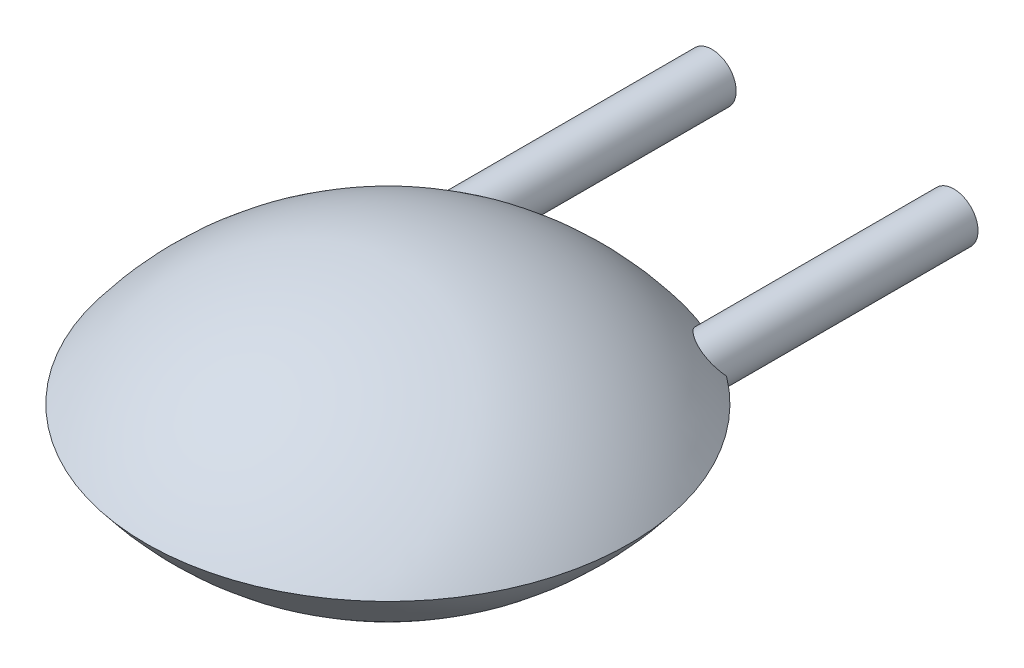
ISO-10303-21;
HEADER;
FILE_DESCRIPTION(('STEP AP214'),'2;1');
FILE_NAME('part.step','',(''),(''),'','','');
FILE_SCHEMA(('AUTOMOTIVE_DESIGN { 1 0 10303 214 1 1 1 1 }'));
ENDSEC;
DATA;
#1=APPLICATION_CONTEXT('core data for automotive mechanical design processes');
#2=APPLICATION_PROTOCOL_DEFINITION('international standard','automotive_design',2000,#1);
#3=PRODUCT_CONTEXT('',#1,'mechanical');
#4=PRODUCT('Part','Part','',(#3));
#5=PRODUCT_RELATED_PRODUCT_CATEGORY('part','',(#4));
#6=PRODUCT_DEFINITION_FORMATION('','',#4);
#7=PRODUCT_DEFINITION_CONTEXT('part definition',#1,'design');
#8=PRODUCT_DEFINITION('design','',#6,#7);
#9=PRODUCT_DEFINITION_SHAPE('','',#8);
#10=(LENGTH_UNIT() NAMED_UNIT(*) SI_UNIT(.MILLI.,.METRE.));
#11=(NAMED_UNIT(*) PLANE_ANGLE_UNIT() SI_UNIT($,.RADIAN.));
#12=(NAMED_UNIT(*) SI_UNIT($,.STERADIAN.) SOLID_ANGLE_UNIT());
#13=UNCERTAINTY_MEASURE_WITH_UNIT(LENGTH_MEASURE(1.E-05),#10,'distance_accuracy_value','');
#14=(GEOMETRIC_REPRESENTATION_CONTEXT(3) GLOBAL_UNCERTAINTY_ASSIGNED_CONTEXT((#13)) GLOBAL_UNIT_ASSIGNED_CONTEXT((#10,
#11,#12)) REPRESENTATION_CONTEXT('',''));
#15=CARTESIAN_POINT('',(0.,0.,0.));
#16=DIRECTION('',(0.,0.,1.));
#17=DIRECTION('',(1.,0.,0.));
#18=AXIS2_PLACEMENT_3D('',#15,#16,#17);
#19=CARTESIAN_POINT('',(-0.255,-0.25,-2.));
#20=DIRECTION('',(0.,0.,-1.));
#21=DIRECTION('',(0.,1.,0.));
#22=AXIS2_PLACEMENT_3D('',#19,#20,#21);
#23=PLANE('',#22);
#24=CARTESIAN_POINT('',(0.,1.26580603637683E-13,-2.));
#25=DIRECTION('',(0.,0.,-1.));
#26=DIRECTION('',(-1.,0.,0.));
#27=AXIS2_PLACEMENT_3D('',#24,#25,#26);
#28=CIRCLE('',#27,0.249999999999979);
#29=CARTESIAN_POINT('',(-0.249999999999979,1.26580603637683E-13,-2.));
#30=VERTEX_POINT('',#29);
#31=EDGE_CURVE('E22',#30,#30,#28,.F.);
#32=ORIENTED_EDGE('',*,*,#31,.F.);
#33=EDGE_LOOP('',(#32));
#34=FACE_BOUND('',#33,.T.);
#35=ADVANCED_FACE('F17',(#34),#23,.T.);
#36=CARTESIAN_POINT('',(2.755,0.25,-2.));
#37=DIRECTION('',(0.,0.,-1.));
#38=DIRECTION('',(0.,-1.,0.));
#39=AXIS2_PLACEMENT_3D('',#36,#37,#38);
#40=PLANE('',#39);
#41=CARTESIAN_POINT('',(2.5,-1.26824549126492E-13,-2.));
#42=DIRECTION('',(0.,0.,-1.));
#43=DIRECTION('',(-1.,0.,0.));
#44=AXIS2_PLACEMENT_3D('',#41,#42,#43);
#45=CIRCLE('',#44,0.249999999999979);
#46=CARTESIAN_POINT('',(2.25000000000002,-1.26824549126492E-13,-2.));
#47=VERTEX_POINT('',#46);
#48=EDGE_CURVE('E79',#47,#47,#45,.F.);
#49=ORIENTED_EDGE('',*,*,#48,.F.);
#50=EDGE_LOOP('',(#49));
#51=FACE_BOUND('',#50,.T.);
#52=ADVANCED_FACE('F90',(#51),#40,.T.);
#53=CARTESIAN_POINT('',(0.,1.26580603637683E-13,0.75717542912601));
#54=DIRECTION('',(0.,0.,-1.));
#55=DIRECTION('',(-1.,0.,0.));
#56=AXIS2_PLACEMENT_3D('',#53,#54,#55);
#57=CYLINDRICAL_SURFACE('',#56,0.249999999999979);
#58=CARTESIAN_POINT('',(0.249999999999979,0.,0.308712152522118));
#59=CARTESIAN_POINT('',(0.249974887696056,0.0164347321287759,0.322170690810646));
#60=CARTESIAN_POINT('',(0.248382529106542,0.0323363501670054,0.336174265768061));
#61=CARTESIAN_POINT('',(0.242477200423322,0.0628303688356653,0.364876044825029));
#62=CARTESIAN_POINT('',(0.238177289849574,0.0774286720713731,0.379570603000389));
#63=CARTESIAN_POINT('',(0.226481015848138,0.107225264332113,0.411530219492215));
#64=CARTESIAN_POINT('',(0.21872930720297,0.122209907240506,0.42886194822538));
#65=CARTESIAN_POINT('',(0.200537083303948,0.150215674843492,0.46380243640612));
#66=CARTESIAN_POINT('',(0.190087381365138,0.163229845032291,0.481411945472095));
#67=CARTESIAN_POINT('',(0.164389654116604,0.189413765710002,0.520068027551324));
#68=CARTESIAN_POINT('',(0.148599202684939,0.202087794276697,0.541093141418843));
#69=CARTESIAN_POINT('',(0.113679425248437,0.22359979280183,0.582298432892593));
#70=CARTESIAN_POINT('',(0.0945593463024086,0.232448156409625,0.602480763513318));
#71=CARTESIAN_POINT('',(0.0622063014461891,0.242439133797182,0.632390902553709));
#72=CARTESIAN_POINT('',(0.050108766034953,0.245259014180756,0.642795260604001));
#73=CARTESIAN_POINT('',(0.0248898010467758,0.249084202039325,0.662667704294307));
#74=CARTESIAN_POINT('',(0.0117698021862417,0.250091999203687,0.672137057629584));
#75=CARTESIAN_POINT('',(-0.0121899119650978,0.249918118531128,0.687572904994148));
#76=CARTESIAN_POINT('',(-0.0228379264895161,0.249196639046879,0.693838886761738));
#77=CARTESIAN_POINT('',(-0.0445466360655283,0.246241875901052,0.705202244029424));
#78=CARTESIAN_POINT('',(-0.0556066733753632,0.24401091179848,0.710301396480512));
#79=CARTESIAN_POINT('',(-0.0755065341695101,0.238498511456264,0.718012767591431));
#80=CARTESIAN_POINT('',(-0.0843191650407306,0.235540686336215,0.720923143914214));
#81=CARTESIAN_POINT('',(-0.101816613763403,0.228521240879112,0.725564280873173));
#82=CARTESIAN_POINT('',(-0.110501537753485,0.224460598989907,0.727296082419261));
#83=CARTESIAN_POINT('',(-0.127511250544184,0.215255120504589,0.729434202058144));
#84=CARTESIAN_POINT('',(-0.135834072485752,0.210105083699667,0.72983400278703));
#85=CARTESIAN_POINT('',(-0.151785020713106,0.198887895745818,0.729249372484822));
#86=CARTESIAN_POINT('',(-0.15941301822005,0.192820575139399,0.728264685406182));
#87=CARTESIAN_POINT('',(-0.173240536645815,0.180464919049424,0.725124705952067));
#88=CARTESIAN_POINT('',(-0.179503288723725,0.174223700448978,0.723058502720093));
#89=CARTESIAN_POINT('',(-0.191160251032919,0.161348259460317,0.717966556917583));
#90=CARTESIAN_POINT('',(-0.196554630680691,0.1547141140771,0.7149410018562));
#91=CARTESIAN_POINT('',(-0.208743686592231,0.138113517406488,0.706527082217513));
#92=CARTESIAN_POINT('',(-0.215046987140967,0.12801337806863,0.700691338095584));
#93=CARTESIAN_POINT('',(-0.22594683891378,0.107622895717588,0.687778939107038));
#94=CARTESIAN_POINT('',(-0.23053300498859,0.0973317782941726,0.680695102925619));
#95=CARTESIAN_POINT('',(-0.239911929268769,0.072101448527847,0.662228729294969));
#96=CARTESIAN_POINT('',(-0.243832370867844,0.0571980118213958,0.650366026822044));
#97=CARTESIAN_POINT('',(-0.248841802973233,0.0280800610806456,0.625727328697351));
#98=CARTESIAN_POINT('',(-0.249976577904593,0.0138582276291967,0.612969696173424));
#99=CARTESIAN_POINT('',(-0.249999999999979,0.,0.599999999999935));
#100=B_SPLINE_CURVE_WITH_KNOTS('',3,(#58,#59,#60,#61,#62,#63,#64,#65,#66,#67,#68,#69,#70,#71,
#72,#73,#74,#75,#76,#77,#78,#79,#80,#81,#82,#83,#84,#85,#86,#87,#88,#89,#90,#91,#92,#93,#94,#95,
#96,#97,#98,#99),.UNSPECIFIED.,.F.,.F.,(4,2,2,2,2,2,2,2,2,2,2,2,2,2,2,2,2,2,2,2,4),(0.,
0.0635595560740722,0.126814865024121,0.199132003494415,0.271698706531342,0.358868576615973,
0.445800110381571,0.494290870198534,0.542714955678231,0.579721903869753,0.616672113867289,
0.64577699056054,0.674856128531721,0.704077340855822,0.733303958069641,0.760432919831089,
0.787556582393535,0.82711180115567,0.866902525275797,0.924966376314439,0.982069319442887),.UNSPECIFIED.);
#101=CARTESIAN_POINT('',(0.249999999999979,0.,0.308712152522138));
#102=VERTEX_POINT('',#101);
#103=CARTESIAN_POINT('',(-0.249999999999979,0.,0.600000000000016));
#104=VERTEX_POINT('',#103);
#105=EDGE_CURVE('E45',#102,#104,#100,.T.);
#106=ORIENTED_EDGE('',*,*,#105,.F.);
#107=CARTESIAN_POINT('',(-0.249999999999979,-1.03580149476624E-13,0.600000000000097));
#108=CARTESIAN_POINT('',(-0.249968315005164,-0.0152953630539641,0.614307261235103));
#109=CARTESIAN_POINT('',(-0.248586504430588,-0.0310691323429222,0.628397485276159));
#110=CARTESIAN_POINT('',(-0.242415632273045,-0.0633614647499092,0.655385017296713));
#111=CARTESIAN_POINT('',(-0.237573988318083,-0.0798877902622666,0.668260400497584));
#112=CARTESIAN_POINT('',(-0.226840277474347,-0.105546588593829,0.6863274069291));
#113=CARTESIAN_POINT('',(-0.222394594395265,-0.114669020400682,0.692374307778556));
#114=CARTESIAN_POINT('',(-0.21211410354781,-0.132721751452653,0.703414113960093));
#115=CARTESIAN_POINT('',(-0.206285642489611,-0.141652730997906,0.708411643755678));
#116=CARTESIAN_POINT('',(-0.1941822339536,-0.15772735711613,0.716365139998045));
#117=CARTESIAN_POINT('',(-0.188119940098436,-0.164931969807161,0.719518215902645));
#118=CARTESIAN_POINT('',(-0.174969165434126,-0.178821287038762,0.724632339892098));
#119=CARTESIAN_POINT('',(-0.167880908867803,-0.18550610470046,0.726593647973818));
#120=CARTESIAN_POINT('',(-0.152774454871784,-0.198134533471481,0.729154972080427));
#121=CARTESIAN_POINT('',(-0.14475138803359,-0.204073895209913,0.729747491719957));
#122=CARTESIAN_POINT('',(-0.12806749270662,-0.214936675441069,0.729487035437101));
#123=CARTESIAN_POINT('',(-0.119406727735215,-0.219860194930645,0.728634203291928));
#124=CARTESIAN_POINT('',(-0.10256843545303,-0.228166345186262,0.725711624186339));
#125=CARTESIAN_POINT('',(-0.0944184532056752,-0.23164830677619,0.723759427238487));
#126=CARTESIAN_POINT('',(-0.0780649341332175,-0.237659141657604,0.718877508051946));
#127=CARTESIAN_POINT('',(-0.0698613806509813,-0.240187702594833,0.715947466042134));
#128=CARTESIAN_POINT('',(-0.0511165529019866,-0.244962477245274,0.708276469800054));
#129=CARTESIAN_POINT('',(-0.040611105234473,-0.246897236480397,0.703255970411835));
#130=CARTESIAN_POINT('',(-0.0199885647602941,-0.249416858689239,0.692188084747817));
#131=CARTESIAN_POINT('',(-0.0098721487962475,-0.249999465171378,0.68613899997886));
#132=CARTESIAN_POINT('',(0.0178413147298952,-0.250000966561776,0.668101274239287));
#133=CARTESIAN_POINT('',(0.0348848269083074,-0.248100825191584,0.65525977920515));
#134=CARTESIAN_POINT('',(0.0671965581881064,-0.241367659280467,0.628186466608448));
#135=CARTESIAN_POINT('',(0.0824579250333904,-0.236523731819276,0.613949646372646));
#136=CARTESIAN_POINT('',(0.115237390725993,-0.222753792143571,0.580565175806371));
#137=CARTESIAN_POINT('',(0.132175940383532,-0.213061352044566,0.561165971981635));
#138=CARTESIAN_POINT('',(0.163039394009783,-0.190482829774048,0.521857549280326));
#139=CARTESIAN_POINT('',(0.176962303524375,-0.177594646043373,0.501948002552135));
#140=CARTESIAN_POINT('',(0.201849083733664,-0.148751920045032,0.461726012037251));
#141=CARTESIAN_POINT('',(0.212746852681304,-0.1327402285301,0.441413628118798));
#142=CARTESIAN_POINT('',(0.230736972720684,-0.0981755640070875,0.401345191382363));
#143=CARTESIAN_POINT('',(0.237841645628006,-0.0796310683943451,0.381587537169255));
#144=CARTESIAN_POINT('',(0.245046625457634,-0.0504773630747687,0.353132566563741));
#145=CARTESIAN_POINT('',(0.24686950268506,-0.0407118377338342,0.343989300033733));
#146=CARTESIAN_POINT('',(0.249344543023649,-0.0207016797178951,0.326058287401227));
#147=CARTESIAN_POINT('',(0.249995531023082,-0.0104565766935295,0.317270906782021));
#148=CARTESIAN_POINT('',(0.249999999999979,0.,0.308712152522104));
#149=B_SPLINE_CURVE_WITH_KNOTS('',3,(#107,#108,#109,#110,#111,#112,#113,#114,#115,#116,#117,
#118,#119,#120,#121,#122,#123,#124,#125,#126,#127,#128,#129,#130,#131,#132,#133,#134,#135,#136,
#137,#138,#139,#140,#141,#142,#143,#144,#145,#146,#147,#148),.UNSPECIFIED.,.F.,.F.,(4,2,2,2,2,2,
2,2,2,2,2,2,2,2,2,2,2,2,2,2,4),(0.,0.0631169965110011,0.127214219304128,0.162547660109248,
0.197721961386932,0.227391076018451,0.257053715689982,0.286878426235304,0.316700170124249,
0.343813602857835,0.370935910824029,0.406182541375695,0.441487949837905,0.505293198022058,
0.569336214671416,0.651462563020569,0.733643062538749,0.817498720668092,0.901080291432057,
0.941528484933231,0.982017215308666),.UNSPECIFIED.);
#150=EDGE_CURVE('E53',#104,#102,#149,.T.);
#151=ORIENTED_EDGE('',*,*,#150,.F.);
#152=EDGE_LOOP('',(#106,#151));
#153=FACE_BOUND('',#152,.T.);
#154=ORIENTED_EDGE('',*,*,#31,.T.);
#155=EDGE_LOOP('',(#154));
#156=FACE_BOUND('',#155,.T.);
#157=ADVANCED_FACE('F54',(#153,#156),#57,.T.);
#158=CARTESIAN_POINT('',(2.5,-1.26824549126492E-13,0.75717542912399));
#159=DIRECTION('',(0.,0.,-1.));
#160=DIRECTION('',(-1.,0.,0.));
#161=AXIS2_PLACEMENT_3D('',#158,#159,#160);
#162=CYLINDRICAL_SURFACE('',#161,0.249999999999979);
#163=CARTESIAN_POINT('',(2.74999999999998,1.1149843291083E-13,0.600000000000104));
#164=CARTESIAN_POINT('',(2.74996831500516,0.0152953630539719,0.61430726123511));
#165=CARTESIAN_POINT('',(2.74858650443059,0.0310691323429302,0.628397485276166));
#166=CARTESIAN_POINT('',(2.74241563227304,0.0633614647499179,0.655385017296719));
#167=CARTESIAN_POINT('',(2.73757398831808,0.0798877902622756,0.668260400497589));
#168=CARTESIAN_POINT('',(2.72684027747434,0.105546588593838,0.686327406929105));
#169=CARTESIAN_POINT('',(2.72239459439526,0.11466902040069,0.692374307778561));
#170=CARTESIAN_POINT('',(2.71211410354781,0.13272175145266,0.703414113960097));
#171=CARTESIAN_POINT('',(2.70628564248961,0.141652730997912,0.708411643755682));
#172=CARTESIAN_POINT('',(2.6941822339536,0.157727357116137,0.716365139998048));
#173=CARTESIAN_POINT('',(2.68811994009843,0.164931969807167,0.719518215902647));
#174=CARTESIAN_POINT('',(2.67496916543412,0.178821287038768,0.724632339892099));
#175=CARTESIAN_POINT('',(2.6678809088678,0.185506104700465,0.726593647973818));
#176=CARTESIAN_POINT('',(2.65277445487178,0.198134533471485,0.729154972080427));
#177=CARTESIAN_POINT('',(2.64475138803358,0.204073895209917,0.729747491719957));
#178=CARTESIAN_POINT('',(2.62806749270661,0.214936675441073,0.729487035437099));
#179=CARTESIAN_POINT('',(2.61940672773521,0.219860194930648,0.728634203291926));
#180=CARTESIAN_POINT('',(2.60256843545302,0.228166345186265,0.725711624186337));
#181=CARTESIAN_POINT('',(2.59441845320567,0.231648306776193,0.723759427238486));
#182=CARTESIAN_POINT('',(2.57806493413321,0.237659141657606,0.718877508051944));
#183=CARTESIAN_POINT('',(2.56986138065098,0.240187702594835,0.715947466042131));
#184=CARTESIAN_POINT('',(2.55111655290198,0.244962477245274,0.70827646980005));
#185=CARTESIAN_POINT('',(2.54061110523447,0.246897236480397,0.703255970411833));
#186=CARTESIAN_POINT('',(2.51998856476029,0.249416858689239,0.692188084747816));
#187=CARTESIAN_POINT('',(2.50987214879625,0.249999465171378,0.686138999978859));
#188=CARTESIAN_POINT('',(2.48215868527011,0.250000966561776,0.668101274239285));
#189=CARTESIAN_POINT('',(2.46511517309169,0.248100825191583,0.655259779205148));
#190=CARTESIAN_POINT('',(2.43280344181189,0.241367659280467,0.628186466608447));
#191=CARTESIAN_POINT('',(2.41754207496661,0.236523731819275,0.613949646372645));
#192=CARTESIAN_POINT('',(2.38476260927401,0.222753792143571,0.58056517580637));
#193=CARTESIAN_POINT('',(2.36782405961647,0.213061352044565,0.561165971981634));
#194=CARTESIAN_POINT('',(2.33696060599022,0.190482829774048,0.521857549280325));
#195=CARTESIAN_POINT('',(2.32303769647562,0.177594646043373,0.501948002552134));
#196=CARTESIAN_POINT('',(2.29815091626634,0.148751920045032,0.46172601203725));
#197=CARTESIAN_POINT('',(2.2872531473187,0.1327402285301,0.441413628118797));
#198=CARTESIAN_POINT('',(2.26926302727932,0.0981755640070872,0.401345191382362));
#199=CARTESIAN_POINT('',(2.26215835437199,0.079631068394345,0.381587537169254));
#200=CARTESIAN_POINT('',(2.25495337454237,0.0504773630747683,0.35313256656374));
#201=CARTESIAN_POINT('',(2.25313049731494,0.0407118377338334,0.343989300033732));
#202=CARTESIAN_POINT('',(2.25065545697635,0.0207016797178937,0.326058287401226));
#203=CARTESIAN_POINT('',(2.25000446897692,0.0104565766935277,0.317270906782019));
#204=CARTESIAN_POINT('',(2.25000000000002,0.,0.308712152522102));
#205=B_SPLINE_CURVE_WITH_KNOTS('',3,(#163,#164,#165,#166,#167,#168,#169,#170,#171,#172,#173,
#174,#175,#176,#177,#178,#179,#180,#181,#182,#183,#184,#185,#186,#187,#188,#189,#190,#191,#192,
#193,#194,#195,#196,#197,#198,#199,#200,#201,#202,#203,#204),.UNSPECIFIED.,.F.,.F.,(4,2,2,2,2,2,
2,2,2,2,2,2,2,2,2,2,2,2,2,2,4),(0.,0.0631169965110011,0.127214219304128,0.162547660109247,
0.19772196138693,0.227391076018448,0.257053715689979,0.286878426235301,0.316700170124244,
0.343813602857831,0.370935910824024,0.406182541375687,0.441487949837894,0.505293198022048,
0.569336214671405,0.651462563020559,0.733643062538739,0.817498720668082,0.901080291432046,
0.941528484933221,0.982017215308657),.UNSPECIFIED.);
#206=CARTESIAN_POINT('',(2.74999999999998,0.,0.600000000000014));
#207=VERTEX_POINT('',#206);
#208=CARTESIAN_POINT('',(2.25000000000002,0.,0.30871215252211));
#209=VERTEX_POINT('',#208);
#210=EDGE_CURVE('E34',#207,#209,#205,.T.);
#211=ORIENTED_EDGE('',*,*,#210,.F.);
#212=CARTESIAN_POINT('',(2.25000000000002,0.,0.308712152522119));
#213=CARTESIAN_POINT('',(2.25002511230394,-0.0164347321287785,0.322170690810648));
#214=CARTESIAN_POINT('',(2.25161747089346,-0.0323363501670079,0.336174265768063));
#215=CARTESIAN_POINT('',(2.25752279957668,-0.0628303688356675,0.364876044825031));
#216=CARTESIAN_POINT('',(2.26182271015043,-0.0774286720713753,0.379570603000391));
#217=CARTESIAN_POINT('',(2.27351898415186,-0.107225264332115,0.411530219492217));
#218=CARTESIAN_POINT('',(2.28127069279703,-0.122209907240508,0.428861948225382));
#219=CARTESIAN_POINT('',(2.29946291669605,-0.150215674843495,0.463802436406122));
#220=CARTESIAN_POINT('',(2.30991261863486,-0.163229845032293,0.481411945472097));
#221=CARTESIAN_POINT('',(2.3356103458834,-0.189413765710004,0.520068027551326));
#222=CARTESIAN_POINT('',(2.35140079731506,-0.202087794276699,0.541093141418846));
#223=CARTESIAN_POINT('',(2.38632057475157,-0.223599792801832,0.582298432892596));
#224=CARTESIAN_POINT('',(2.40544065369759,-0.232448156409626,0.602480763513321));
#225=CARTESIAN_POINT('',(2.43779369855381,-0.242439133797183,0.632390902553712));
#226=CARTESIAN_POINT('',(2.44989123396505,-0.245259014180757,0.642795260604003));
#227=CARTESIAN_POINT('',(2.47511019895323,-0.249084202039326,0.662667704294309));
#228=CARTESIAN_POINT('',(2.48823019781376,-0.250091999203687,0.672137057629585));
#229=CARTESIAN_POINT('',(2.5121899119651,-0.249918118531128,0.687572904994148));
#230=CARTESIAN_POINT('',(2.52283792648952,-0.249196639046879,0.693838886761739));
#231=CARTESIAN_POINT('',(2.54454663606553,-0.246241875901052,0.705202244029424));
#232=CARTESIAN_POINT('',(2.55560667337536,-0.24401091179848,0.710301396480512));
#233=CARTESIAN_POINT('',(2.57550653416951,-0.238498511456264,0.718012767591431));
#234=CARTESIAN_POINT('',(2.58431916504073,-0.235540686336215,0.720923143914215));
#235=CARTESIAN_POINT('',(2.6018166137634,-0.228521240879112,0.725564280873173));
#236=CARTESIAN_POINT('',(2.61050153775349,-0.224460598989906,0.72729608241926));
#237=CARTESIAN_POINT('',(2.62751125054419,-0.215255120504589,0.729434202058143));
#238=CARTESIAN_POINT('',(2.63583407248575,-0.210105083699667,0.72983400278703));
#239=CARTESIAN_POINT('',(2.65178502071311,-0.198887895745817,0.729249372484822));
#240=CARTESIAN_POINT('',(2.65941301822005,-0.192820575139399,0.728264685406182));
#241=CARTESIAN_POINT('',(2.67324053664582,-0.180464919049423,0.725124705952067));
#242=CARTESIAN_POINT('',(2.67950328872373,-0.174223700448978,0.723058502720093));
#243=CARTESIAN_POINT('',(2.69116025103292,-0.161348259460317,0.717966556917582));
#244=CARTESIAN_POINT('',(2.69655463068069,-0.154714114077099,0.714941001856199));
#245=CARTESIAN_POINT('',(2.70874368659223,-0.138113517406487,0.706527082217512));
#246=CARTESIAN_POINT('',(2.71504698714097,-0.128013378068629,0.700691338095583));
#247=CARTESIAN_POINT('',(2.72594683891378,-0.107622895717586,0.687778939107037));
#248=CARTESIAN_POINT('',(2.73053300498859,-0.0973317782941709,0.680695102925618));
#249=CARTESIAN_POINT('',(2.73991192926877,-0.0721014485278442,0.662228729294966));
#250=CARTESIAN_POINT('',(2.74383237086785,-0.0571980118213918,0.65036602682204));
#251=CARTESIAN_POINT('',(2.74884180297323,-0.0280800610806394,0.625727328697345));
#252=CARTESIAN_POINT('',(2.74997657790459,-0.0138582276291897,0.612969696173418));
#253=CARTESIAN_POINT('',(2.74999999999998,0.,0.599999999999927));
#254=B_SPLINE_CURVE_WITH_KNOTS('',3,(#212,#213,#214,#215,#216,#217,#218,#219,#220,#221,#222,
#223,#224,#225,#226,#227,#228,#229,#230,#231,#232,#233,#234,#235,#236,#237,#238,#239,#240,#241,
#242,#243,#244,#245,#246,#247,#248,#249,#250,#251,#252,#253),.UNSPECIFIED.,.F.,.F.,(4,2,2,2,2,2,
2,2,2,2,2,2,2,2,2,2,2,2,2,2,4),(0.,0.0635595560740722,0.126814865024121,0.199132003494415,
0.271698706531343,0.358868576615974,0.445800110381572,0.494290870198534,0.54271495567823,
0.579721903869752,0.616672113867287,0.645776990560539,0.674856128531721,0.704077340855821,
0.73330395806964,0.760432919831088,0.787556582393534,0.82711180115567,0.866902525275797,
0.924966376314443,0.982069319442895),.UNSPECIFIED.);
#255=EDGE_CURVE('E11',#209,#207,#254,.T.);
#256=ORIENTED_EDGE('',*,*,#255,.F.);
#257=EDGE_LOOP('',(#211,#256));
#258=FACE_BOUND('',#257,.T.);
#259=ORIENTED_EDGE('',*,*,#48,.T.);
#260=EDGE_LOOP('',(#259));
#261=FACE_BOUND('',#260,.T.);
#262=ADVANCED_FACE('F68',(#258,#261),#162,.T.);
#263=CARTESIAN_POINT('',(1.25,-1.87499999999998,2.6));
#264=DIRECTION('',(0.,-1.,0.));
#265=DIRECTION('',(-1.,0.,0.));
#266=AXIS2_PLACEMENT_3D('',#263,#264,#265);
#267=SPHERICAL_SURFACE('',#266,3.12499999999998);
#268=CARTESIAN_POINT('',(1.25000000000011,0.,2.6));
#269=DIRECTION('',(0.,-1.,0.));
#270=DIRECTION('',(0.,0.,-1.));
#271=AXIS2_PLACEMENT_3D('',#268,#269,#270);
#272=CIRCLE('',#271,2.49999999999998);
#273=EDGE_CURVE('E49',#207,#104,#272,.T.);
#274=ORIENTED_EDGE('',*,*,#273,.F.);
#275=ORIENTED_EDGE('',*,*,#210,.T.);
#276=CARTESIAN_POINT('',(1.25000000000011,0.,2.6));
#277=DIRECTION('',(0.,-1.,0.));
#278=DIRECTION('',(0.,0.,-1.));
#279=AXIS2_PLACEMENT_3D('',#276,#277,#278);
#280=CIRCLE('',#279,2.49999999999998);
#281=EDGE_CURVE('E27',#102,#209,#280,.T.);
#282=ORIENTED_EDGE('',*,*,#281,.F.);
#283=ORIENTED_EDGE('',*,*,#105,.T.);
#284=EDGE_LOOP('',(#274,#275,#282,#283));
#285=FACE_BOUND('',#284,.T.);
#286=ADVANCED_FACE('F47',(#285),#267,.T.);
#287=CARTESIAN_POINT('',(1.25,1.87499999999998,2.6));
#288=DIRECTION('',(0.,-1.,0.));
#289=DIRECTION('',(-1.,0.,0.));
#290=AXIS2_PLACEMENT_3D('',#287,#288,#289);
#291=SPHERICAL_SURFACE('',#290,3.12499999999998);
#292=ORIENTED_EDGE('',*,*,#255,.T.);
#293=ORIENTED_EDGE('',*,*,#273,.T.);
#294=ORIENTED_EDGE('',*,*,#150,.T.);
#295=ORIENTED_EDGE('',*,*,#281,.T.);
#296=EDGE_LOOP('',(#292,#293,#294,#295));
#297=FACE_BOUND('',#296,.T.);
#298=ADVANCED_FACE('F19',(#297),#291,.T.);
#299=CLOSED_SHELL('',(#35,#52,#157,#262,#286,#298));
#300=MANIFOLD_SOLID_BREP('B1',#299);
#301=ADVANCED_BREP_SHAPE_REPRESENTATION('',(#18,#300),#14);
#302=SHAPE_DEFINITION_REPRESENTATION(#9,#301);
ENDSEC;
END-ISO-10303-21;
